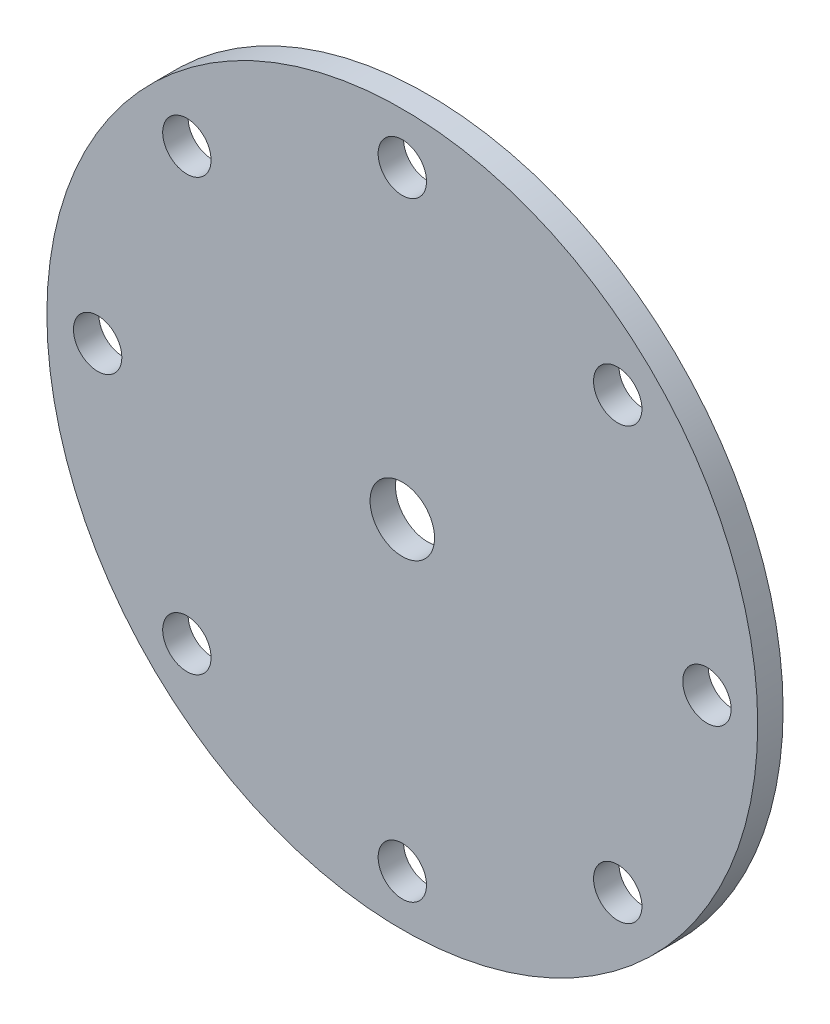
ISO-10303-21;
HEADER;
FILE_DESCRIPTION(('STEP AP214'),'2;1');
FILE_NAME('part.step','',(''),(''),'','','');
FILE_SCHEMA(('AUTOMOTIVE_DESIGN { 1 0 10303 214 1 1 1 1 }'));
ENDSEC;
DATA;
#1=APPLICATION_CONTEXT('core data for automotive mechanical design processes');
#2=APPLICATION_PROTOCOL_DEFINITION('international standard','automotive_design',2000,#1);
#3=PRODUCT_CONTEXT('',#1,'mechanical');
#4=PRODUCT('Part','Part','',(#3));
#5=PRODUCT_RELATED_PRODUCT_CATEGORY('part','',(#4));
#6=PRODUCT_DEFINITION_FORMATION('','',#4);
#7=PRODUCT_DEFINITION_CONTEXT('part definition',#1,'design');
#8=PRODUCT_DEFINITION('design','',#6,#7);
#9=PRODUCT_DEFINITION_SHAPE('','',#8);
#10=(LENGTH_UNIT() NAMED_UNIT(*) SI_UNIT(.MILLI.,.METRE.));
#11=(NAMED_UNIT(*) PLANE_ANGLE_UNIT() SI_UNIT($,.RADIAN.));
#12=(NAMED_UNIT(*) SI_UNIT($,.STERADIAN.) SOLID_ANGLE_UNIT());
#13=UNCERTAINTY_MEASURE_WITH_UNIT(LENGTH_MEASURE(1.E-05),#10,'distance_accuracy_value','');
#14=(GEOMETRIC_REPRESENTATION_CONTEXT(3) GLOBAL_UNCERTAINTY_ASSIGNED_CONTEXT((#13)) GLOBAL_UNIT_ASSIGNED_CONTEXT((#10,
#11,#12)) REPRESENTATION_CONTEXT('',''));
#15=CARTESIAN_POINT('',(0.,0.,0.));
#16=DIRECTION('',(0.,0.,1.));
#17=DIRECTION('',(1.,0.,0.));
#18=AXIS2_PLACEMENT_3D('',#15,#16,#17);
#19=CARTESIAN_POINT('',(0.,0.,5.));
#20=DIRECTION('',(0.,0.,-1.));
#21=DIRECTION('',(-1.,0.,0.));
#22=AXIS2_PLACEMENT_3D('',#19,#20,#21);
#23=CYLINDRICAL_SURFACE('',#22,6.35);
#24=CARTESIAN_POINT('',(0.,0.,5.));
#25=DIRECTION('',(0.,0.,1.));
#26=DIRECTION('',(1.,0.,0.));
#27=AXIS2_PLACEMENT_3D('',#24,#25,#26);
#28=CIRCLE('',#27,6.35);
#29=CARTESIAN_POINT('',(6.35,0.,5.));
#30=VERTEX_POINT('',#29);
#31=EDGE_CURVE('E42',#30,#30,#28,.T.);
#32=ORIENTED_EDGE('',*,*,#31,.T.);
#33=EDGE_LOOP('',(#32));
#34=FACE_BOUND('',#33,.T.);
#35=CARTESIAN_POINT('',(0.,0.,0.));
#36=DIRECTION('',(0.,0.,1.));
#37=DIRECTION('',(1.,0.,0.));
#38=AXIS2_PLACEMENT_3D('',#35,#36,#37);
#39=CIRCLE('',#38,6.35);
#40=CARTESIAN_POINT('',(6.35,0.,0.));
#41=VERTEX_POINT('',#40);
#42=EDGE_CURVE('E74',#41,#41,#39,.T.);
#43=ORIENTED_EDGE('',*,*,#42,.F.);
#44=EDGE_LOOP('',(#43));
#45=FACE_BOUND('',#44,.T.);
#46=ADVANCED_FACE('F34',(#34,#45),#23,.F.);
#47=CARTESIAN_POINT('',(0.,60.,5.));
#48=DIRECTION('',(0.,0.,-1.));
#49=DIRECTION('',(-1.,0.,0.));
#50=AXIS2_PLACEMENT_3D('',#47,#48,#49);
#51=CYLINDRICAL_SURFACE('',#50,4.7625);
#52=CARTESIAN_POINT('',(0.,60.,5.));
#53=DIRECTION('',(0.,0.,1.));
#54=DIRECTION('',(1.,0.,0.));
#55=AXIS2_PLACEMENT_3D('',#52,#53,#54);
#56=CIRCLE('',#55,4.7625);
#57=CARTESIAN_POINT('',(4.7625,60.,5.));
#58=VERTEX_POINT('',#57);
#59=EDGE_CURVE('E47',#58,#58,#56,.T.);
#60=ORIENTED_EDGE('',*,*,#59,.T.);
#61=EDGE_LOOP('',(#60));
#62=FACE_BOUND('',#61,.T.);
#63=CARTESIAN_POINT('',(0.,60.,0.));
#64=DIRECTION('',(0.,0.,1.));
#65=DIRECTION('',(1.,0.,0.));
#66=AXIS2_PLACEMENT_3D('',#63,#64,#65);
#67=CIRCLE('',#66,4.7625);
#68=CARTESIAN_POINT('',(4.7625,60.,0.));
#69=VERTEX_POINT('',#68);
#70=EDGE_CURVE('E72',#69,#69,#67,.T.);
#71=ORIENTED_EDGE('',*,*,#70,.F.);
#72=EDGE_LOOP('',(#71));
#73=FACE_BOUND('',#72,.T.);
#74=ADVANCED_FACE('F107',(#62,#73),#51,.F.);
#75=CARTESIAN_POINT('',(42.4264068711929,42.4264068711929,5.));
#76=DIRECTION('',(0.,0.,-1.));
#77=DIRECTION('',(-1.,0.,0.));
#78=AXIS2_PLACEMENT_3D('',#75,#76,#77);
#79=CYLINDRICAL_SURFACE('',#78,4.7625);
#80=CARTESIAN_POINT('',(42.4264068711929,42.4264068711929,5.));
#81=DIRECTION('',(0.,0.,1.));
#82=DIRECTION('',(1.,0.,0.));
#83=AXIS2_PLACEMENT_3D('',#80,#81,#82);
#84=CIRCLE('',#83,4.7625);
#85=CARTESIAN_POINT('',(47.1889068711929,42.4264068711929,5.));
#86=VERTEX_POINT('',#85);
#87=EDGE_CURVE('E102',#86,#86,#84,.T.);
#88=ORIENTED_EDGE('',*,*,#87,.T.);
#89=EDGE_LOOP('',(#88));
#90=FACE_BOUND('',#89,.T.);
#91=CARTESIAN_POINT('',(42.4264068711929,42.4264068711929,0.));
#92=DIRECTION('',(0.,0.,1.));
#93=DIRECTION('',(1.,0.,0.));
#94=AXIS2_PLACEMENT_3D('',#91,#92,#93);
#95=CIRCLE('',#94,4.7625);
#96=CARTESIAN_POINT('',(47.1889068711929,42.4264068711929,0.));
#97=VERTEX_POINT('',#96);
#98=EDGE_CURVE('E69',#97,#97,#95,.T.);
#99=ORIENTED_EDGE('',*,*,#98,.F.);
#100=EDGE_LOOP('',(#99));
#101=FACE_BOUND('',#100,.T.);
#102=ADVANCED_FACE('F125',(#90,#101),#79,.F.);
#103=CARTESIAN_POINT('',(60.,0.,5.));
#104=DIRECTION('',(0.,0.,-1.));
#105=DIRECTION('',(-1.,0.,0.));
#106=AXIS2_PLACEMENT_3D('',#103,#104,#105);
#107=CYLINDRICAL_SURFACE('',#106,4.7625);
#108=CARTESIAN_POINT('',(60.,0.,5.));
#109=DIRECTION('',(0.,0.,1.));
#110=DIRECTION('',(1.,0.,0.));
#111=AXIS2_PLACEMENT_3D('',#108,#109,#110);
#112=CIRCLE('',#111,4.7625);
#113=CARTESIAN_POINT('',(64.7625,0.,5.));
#114=VERTEX_POINT('',#113);
#115=EDGE_CURVE('E99',#114,#114,#112,.T.);
#116=ORIENTED_EDGE('',*,*,#115,.T.);
#117=EDGE_LOOP('',(#116));
#118=FACE_BOUND('',#117,.T.);
#119=CARTESIAN_POINT('',(60.,0.,0.));
#120=DIRECTION('',(0.,0.,1.));
#121=DIRECTION('',(1.,0.,0.));
#122=AXIS2_PLACEMENT_3D('',#119,#120,#121);
#123=CIRCLE('',#122,4.7625);
#124=CARTESIAN_POINT('',(64.7625,0.,0.));
#125=VERTEX_POINT('',#124);
#126=EDGE_CURVE('E66',#125,#125,#123,.T.);
#127=ORIENTED_EDGE('',*,*,#126,.F.);
#128=EDGE_LOOP('',(#127));
#129=FACE_BOUND('',#128,.T.);
#130=ADVANCED_FACE('F132',(#118,#129),#107,.F.);
#131=CARTESIAN_POINT('',(42.4264068711929,-42.4264068711928,5.));
#132=DIRECTION('',(0.,0.,-1.));
#133=DIRECTION('',(-1.,0.,0.));
#134=AXIS2_PLACEMENT_3D('',#131,#132,#133);
#135=CYLINDRICAL_SURFACE('',#134,4.7625);
#136=CARTESIAN_POINT('',(42.4264068711929,-42.4264068711928,5.));
#137=DIRECTION('',(0.,0.,1.));
#138=DIRECTION('',(1.,0.,0.));
#139=AXIS2_PLACEMENT_3D('',#136,#137,#138);
#140=CIRCLE('',#139,4.7625);
#141=CARTESIAN_POINT('',(47.1889068711929,-42.4264068711928,5.));
#142=VERTEX_POINT('',#141);
#143=EDGE_CURVE('E96',#142,#142,#140,.T.);
#144=ORIENTED_EDGE('',*,*,#143,.T.);
#145=EDGE_LOOP('',(#144));
#146=FACE_BOUND('',#145,.T.);
#147=CARTESIAN_POINT('',(42.4264068711929,-42.4264068711928,0.));
#148=DIRECTION('',(0.,0.,1.));
#149=DIRECTION('',(1.,0.,0.));
#150=AXIS2_PLACEMENT_3D('',#147,#148,#149);
#151=CIRCLE('',#150,4.7625);
#152=CARTESIAN_POINT('',(47.1889068711929,-42.4264068711928,0.));
#153=VERTEX_POINT('',#152);
#154=EDGE_CURVE('E63',#153,#153,#151,.T.);
#155=ORIENTED_EDGE('',*,*,#154,.F.);
#156=EDGE_LOOP('',(#155));
#157=FACE_BOUND('',#156,.T.);
#158=ADVANCED_FACE('F136',(#146,#157),#135,.F.);
#159=CARTESIAN_POINT('',(0.,-60.,5.));
#160=DIRECTION('',(0.,0.,-1.));
#161=DIRECTION('',(-1.,0.,0.));
#162=AXIS2_PLACEMENT_3D('',#159,#160,#161);
#163=CYLINDRICAL_SURFACE('',#162,4.7625);
#164=CARTESIAN_POINT('',(0.,-60.,5.));
#165=DIRECTION('',(0.,0.,1.));
#166=DIRECTION('',(1.,0.,0.));
#167=AXIS2_PLACEMENT_3D('',#164,#165,#166);
#168=CIRCLE('',#167,4.7625);
#169=CARTESIAN_POINT('',(4.76250000000002,-60.,5.));
#170=VERTEX_POINT('',#169);
#171=EDGE_CURVE('E93',#170,#170,#168,.T.);
#172=ORIENTED_EDGE('',*,*,#171,.T.);
#173=EDGE_LOOP('',(#172));
#174=FACE_BOUND('',#173,.T.);
#175=CARTESIAN_POINT('',(0.,-60.,0.));
#176=DIRECTION('',(0.,0.,1.));
#177=DIRECTION('',(1.,0.,0.));
#178=AXIS2_PLACEMENT_3D('',#175,#176,#177);
#179=CIRCLE('',#178,4.7625);
#180=CARTESIAN_POINT('',(4.76250000000002,-60.,0.));
#181=VERTEX_POINT('',#180);
#182=EDGE_CURVE('E60',#181,#181,#179,.T.);
#183=ORIENTED_EDGE('',*,*,#182,.F.);
#184=EDGE_LOOP('',(#183));
#185=FACE_BOUND('',#184,.T.);
#186=ADVANCED_FACE('F140',(#174,#185),#163,.F.);
#187=CARTESIAN_POINT('',(-42.4264068711928,-42.4264068711929,5.));
#188=DIRECTION('',(0.,0.,-1.));
#189=DIRECTION('',(-1.,0.,0.));
#190=AXIS2_PLACEMENT_3D('',#187,#188,#189);
#191=CYLINDRICAL_SURFACE('',#190,4.7625);
#192=CARTESIAN_POINT('',(-42.4264068711928,-42.4264068711929,5.));
#193=DIRECTION('',(0.,0.,1.));
#194=DIRECTION('',(1.,0.,0.));
#195=AXIS2_PLACEMENT_3D('',#192,#193,#194);
#196=CIRCLE('',#195,4.7625);
#197=CARTESIAN_POINT('',(-37.6639068711928,-42.4264068711929,5.));
#198=VERTEX_POINT('',#197);
#199=EDGE_CURVE('E88',#198,#198,#196,.T.);
#200=ORIENTED_EDGE('',*,*,#199,.T.);
#201=EDGE_LOOP('',(#200));
#202=FACE_BOUND('',#201,.T.);
#203=CARTESIAN_POINT('',(-42.4264068711928,-42.4264068711929,0.));
#204=DIRECTION('',(0.,0.,1.));
#205=DIRECTION('',(1.,0.,0.));
#206=AXIS2_PLACEMENT_3D('',#203,#204,#205);
#207=CIRCLE('',#206,4.7625);
#208=CARTESIAN_POINT('',(-37.6639068711928,-42.4264068711929,0.));
#209=VERTEX_POINT('',#208);
#210=EDGE_CURVE('E57',#209,#209,#207,.T.);
#211=ORIENTED_EDGE('',*,*,#210,.F.);
#212=EDGE_LOOP('',(#211));
#213=FACE_BOUND('',#212,.T.);
#214=ADVANCED_FACE('F144',(#202,#213),#191,.F.);
#215=CARTESIAN_POINT('',(-60.,0.,5.));
#216=DIRECTION('',(0.,0.,-1.));
#217=DIRECTION('',(-1.,0.,0.));
#218=AXIS2_PLACEMENT_3D('',#215,#216,#217);
#219=CYLINDRICAL_SURFACE('',#218,4.7625);
#220=CARTESIAN_POINT('',(-60.,0.,5.));
#221=DIRECTION('',(0.,0.,1.));
#222=DIRECTION('',(1.,0.,0.));
#223=AXIS2_PLACEMENT_3D('',#220,#221,#222);
#224=CIRCLE('',#223,4.7625);
#225=CARTESIAN_POINT('',(-55.2375,0.,5.));
#226=VERTEX_POINT('',#225);
#227=EDGE_CURVE('E83',#226,#226,#224,.T.);
#228=ORIENTED_EDGE('',*,*,#227,.T.);
#229=EDGE_LOOP('',(#228));
#230=FACE_BOUND('',#229,.T.);
#231=CARTESIAN_POINT('',(-60.,0.,0.));
#232=DIRECTION('',(0.,0.,1.));
#233=DIRECTION('',(1.,0.,0.));
#234=AXIS2_PLACEMENT_3D('',#231,#232,#233);
#235=CIRCLE('',#234,4.7625);
#236=CARTESIAN_POINT('',(-55.2375,0.,0.));
#237=VERTEX_POINT('',#236);
#238=EDGE_CURVE('E54',#237,#237,#235,.T.);
#239=ORIENTED_EDGE('',*,*,#238,.F.);
#240=EDGE_LOOP('',(#239));
#241=FACE_BOUND('',#240,.T.);
#242=ADVANCED_FACE('F147',(#230,#241),#219,.F.);
#243=CARTESIAN_POINT('',(-42.4264068711929,42.4264068711928,5.));
#244=DIRECTION('',(0.,0.,-1.));
#245=DIRECTION('',(-1.,0.,0.));
#246=AXIS2_PLACEMENT_3D('',#243,#244,#245);
#247=CYLINDRICAL_SURFACE('',#246,4.7625);
#248=CARTESIAN_POINT('',(-42.4264068711929,42.4264068711928,5.));
#249=DIRECTION('',(0.,0.,1.));
#250=DIRECTION('',(1.,0.,0.));
#251=AXIS2_PLACEMENT_3D('',#248,#249,#250);
#252=CIRCLE('',#251,4.7625);
#253=CARTESIAN_POINT('',(-37.6639068711929,42.4264068711928,5.));
#254=VERTEX_POINT('',#253);
#255=EDGE_CURVE('E79',#254,#254,#252,.T.);
#256=ORIENTED_EDGE('',*,*,#255,.T.);
#257=EDGE_LOOP('',(#256));
#258=FACE_BOUND('',#257,.T.);
#259=CARTESIAN_POINT('',(-42.4264068711929,42.4264068711928,0.));
#260=DIRECTION('',(0.,0.,1.));
#261=DIRECTION('',(1.,0.,0.));
#262=AXIS2_PLACEMENT_3D('',#259,#260,#261);
#263=CIRCLE('',#262,4.7625);
#264=CARTESIAN_POINT('',(-37.6639068711929,42.4264068711928,0.));
#265=VERTEX_POINT('',#264);
#266=EDGE_CURVE('E51',#265,#265,#263,.T.);
#267=ORIENTED_EDGE('',*,*,#266,.F.);
#268=EDGE_LOOP('',(#267));
#269=FACE_BOUND('',#268,.T.);
#270=ADVANCED_FACE('F36',(#258,#269),#247,.F.);
#271=CARTESIAN_POINT('',(0.,0.,5.));
#272=DIRECTION('',(0.,0.,-1.));
#273=DIRECTION('',(-1.,0.,0.));
#274=AXIS2_PLACEMENT_3D('',#271,#272,#273);
#275=CYLINDRICAL_SURFACE('',#274,70.);
#276=CARTESIAN_POINT('',(0.,0.,5.));
#277=DIRECTION('',(0.,0.,1.));
#278=DIRECTION('',(1.,0.,0.));
#279=AXIS2_PLACEMENT_3D('',#276,#277,#278);
#280=CIRCLE('',#279,70.);
#281=CARTESIAN_POINT('',(70.,0.,5.));
#282=VERTEX_POINT('',#281);
#283=EDGE_CURVE('E10',#282,#282,#280,.T.);
#284=ORIENTED_EDGE('',*,*,#283,.F.);
#285=EDGE_LOOP('',(#284));
#286=FACE_BOUND('',#285,.T.);
#287=CARTESIAN_POINT('',(0.,0.,0.));
#288=DIRECTION('',(0.,0.,1.));
#289=DIRECTION('',(1.,0.,0.));
#290=AXIS2_PLACEMENT_3D('',#287,#288,#289);
#291=CIRCLE('',#290,70.);
#292=CARTESIAN_POINT('',(70.,0.,0.));
#293=VERTEX_POINT('',#292);
#294=EDGE_CURVE('E38',#293,#293,#291,.T.);
#295=ORIENTED_EDGE('',*,*,#294,.T.);
#296=EDGE_LOOP('',(#295));
#297=FACE_BOUND('',#296,.T.);
#298=ADVANCED_FACE('F114',(#286,#297),#275,.T.);
#299=CARTESIAN_POINT('',(0.,0.,5.));
#300=DIRECTION('',(0.,0.,1.));
#301=DIRECTION('',(1.,0.,0.));
#302=AXIS2_PLACEMENT_3D('',#299,#300,#301);
#303=PLANE('',#302);
#304=ORIENTED_EDGE('',*,*,#255,.F.);
#305=EDGE_LOOP('',(#304));
#306=FACE_BOUND('',#305,.T.);
#307=ORIENTED_EDGE('',*,*,#227,.F.);
#308=EDGE_LOOP('',(#307));
#309=FACE_BOUND('',#308,.T.);
#310=ORIENTED_EDGE('',*,*,#199,.F.);
#311=EDGE_LOOP('',(#310));
#312=FACE_BOUND('',#311,.T.);
#313=ORIENTED_EDGE('',*,*,#171,.F.);
#314=EDGE_LOOP('',(#313));
#315=FACE_BOUND('',#314,.T.);
#316=ORIENTED_EDGE('',*,*,#143,.F.);
#317=EDGE_LOOP('',(#316));
#318=FACE_BOUND('',#317,.T.);
#319=ORIENTED_EDGE('',*,*,#115,.F.);
#320=EDGE_LOOP('',(#319));
#321=FACE_BOUND('',#320,.T.);
#322=ORIENTED_EDGE('',*,*,#87,.F.);
#323=EDGE_LOOP('',(#322));
#324=FACE_BOUND('',#323,.T.);
#325=ORIENTED_EDGE('',*,*,#59,.F.);
#326=EDGE_LOOP('',(#325));
#327=FACE_BOUND('',#326,.T.);
#328=ORIENTED_EDGE('',*,*,#31,.F.);
#329=EDGE_LOOP('',(#328));
#330=FACE_BOUND('',#329,.T.);
#331=ORIENTED_EDGE('',*,*,#283,.T.);
#332=EDGE_LOOP('',(#331));
#333=FACE_BOUND('',#332,.T.);
#334=ADVANCED_FACE('F110',(#306,#309,#312,#315,#318,#321,#324,#327,#330,#333),#303,.T.);
#335=CARTESIAN_POINT('',(0.,0.,0.));
#336=DIRECTION('',(0.,0.,1.));
#337=DIRECTION('',(1.,0.,0.));
#338=AXIS2_PLACEMENT_3D('',#335,#336,#337);
#339=PLANE('',#338);
#340=ORIENTED_EDGE('',*,*,#266,.T.);
#341=EDGE_LOOP('',(#340));
#342=FACE_BOUND('',#341,.T.);
#343=ORIENTED_EDGE('',*,*,#238,.T.);
#344=EDGE_LOOP('',(#343));
#345=FACE_BOUND('',#344,.T.);
#346=ORIENTED_EDGE('',*,*,#210,.T.);
#347=EDGE_LOOP('',(#346));
#348=FACE_BOUND('',#347,.T.);
#349=ORIENTED_EDGE('',*,*,#182,.T.);
#350=EDGE_LOOP('',(#349));
#351=FACE_BOUND('',#350,.T.);
#352=ORIENTED_EDGE('',*,*,#154,.T.);
#353=EDGE_LOOP('',(#352));
#354=FACE_BOUND('',#353,.T.);
#355=ORIENTED_EDGE('',*,*,#126,.T.);
#356=EDGE_LOOP('',(#355));
#357=FACE_BOUND('',#356,.T.);
#358=ORIENTED_EDGE('',*,*,#98,.T.);
#359=EDGE_LOOP('',(#358));
#360=FACE_BOUND('',#359,.T.);
#361=ORIENTED_EDGE('',*,*,#70,.T.);
#362=EDGE_LOOP('',(#361));
#363=FACE_BOUND('',#362,.T.);
#364=ORIENTED_EDGE('',*,*,#42,.T.);
#365=EDGE_LOOP('',(#364));
#366=FACE_BOUND('',#365,.T.);
#367=ORIENTED_EDGE('',*,*,#294,.F.);
#368=EDGE_LOOP('',(#367));
#369=FACE_BOUND('',#368,.T.);
#370=ADVANCED_FACE('F113',(#342,#345,#348,#351,#354,#357,#360,#363,#366,#369),#339,.F.);
#371=CLOSED_SHELL('',(#46,#74,#102,#130,#158,#186,#214,#242,#270,#298,#334,#370));
#372=MANIFOLD_SOLID_BREP('B2',#371);
#373=ADVANCED_BREP_SHAPE_REPRESENTATION('',(#18,#372),#14);
#374=SHAPE_DEFINITION_REPRESENTATION(#9,#373);
ENDSEC;
END-ISO-10303-21;
